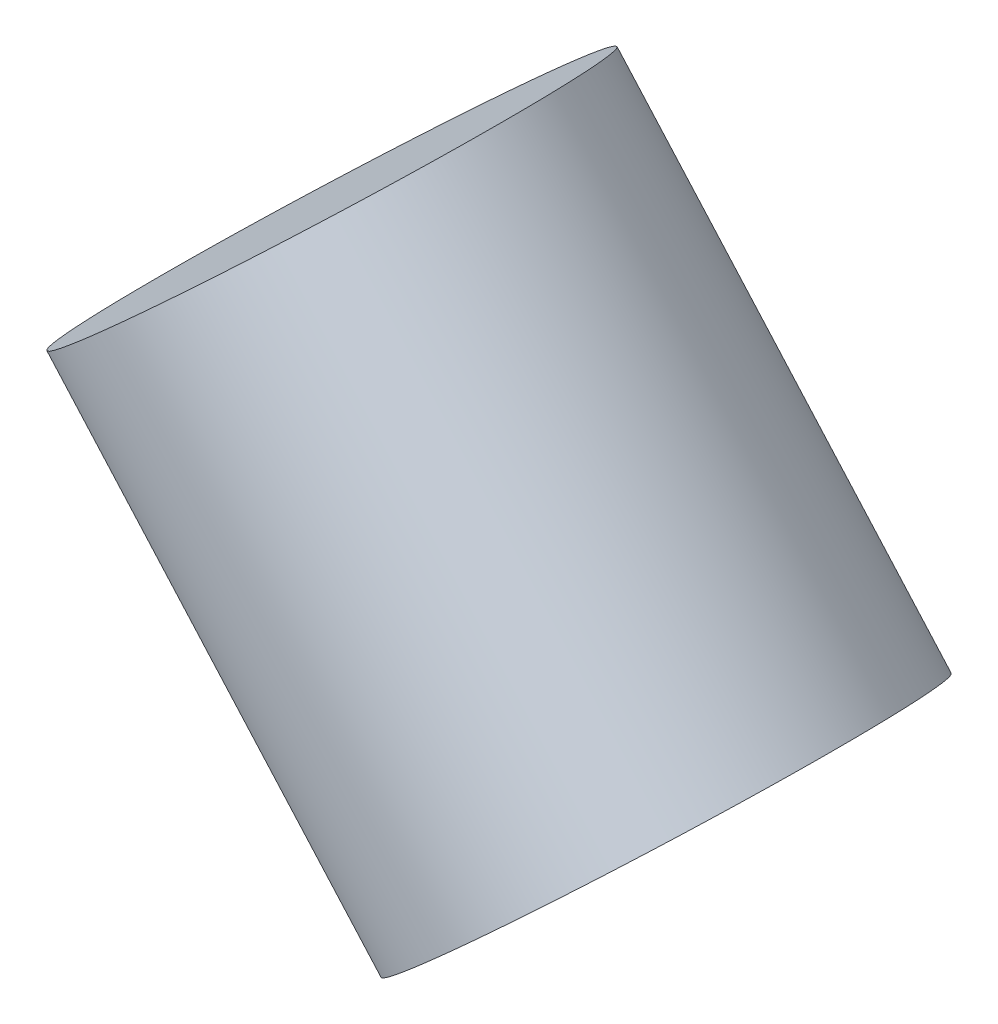
ISO-10303-21;
HEADER;
FILE_DESCRIPTION(('STEP AP214'),'2;1');
FILE_NAME('part.step','',(''),(''),'','','');
FILE_SCHEMA(('AUTOMOTIVE_DESIGN { 1 0 10303 214 1 1 1 1 }'));
ENDSEC;
DATA;
#1=APPLICATION_CONTEXT('core data for automotive mechanical design processes');
#2=APPLICATION_PROTOCOL_DEFINITION('international standard','automotive_design',2000,#1);
#3=PRODUCT_CONTEXT('',#1,'mechanical');
#4=PRODUCT('Part','Part','',(#3));
#5=PRODUCT_RELATED_PRODUCT_CATEGORY('part','',(#4));
#6=PRODUCT_DEFINITION_FORMATION('','',#4);
#7=PRODUCT_DEFINITION_CONTEXT('part definition',#1,'design');
#8=PRODUCT_DEFINITION('design','',#6,#7);
#9=PRODUCT_DEFINITION_SHAPE('','',#8);
#10=(LENGTH_UNIT() NAMED_UNIT(*) SI_UNIT(.MILLI.,.METRE.));
#11=(NAMED_UNIT(*) PLANE_ANGLE_UNIT() SI_UNIT($,.RADIAN.));
#12=(NAMED_UNIT(*) SI_UNIT($,.STERADIAN.) SOLID_ANGLE_UNIT());
#13=UNCERTAINTY_MEASURE_WITH_UNIT(LENGTH_MEASURE(1.E-05),#10,'distance_accuracy_value','');
#14=(GEOMETRIC_REPRESENTATION_CONTEXT(3) GLOBAL_UNCERTAINTY_ASSIGNED_CONTEXT((#13)) GLOBAL_UNIT_ASSIGNED_CONTEXT((#10,
#11,#12)) REPRESENTATION_CONTEXT('',''));
#15=CARTESIAN_POINT('',(0.,0.,0.));
#16=DIRECTION('',(0.,0.,1.));
#17=DIRECTION('',(1.,0.,0.));
#18=AXIS2_PLACEMENT_3D('',#15,#16,#17);
#19=CARTESIAN_POINT('',(70.8192282172992,-16.9151301511175,-22.6758389365389));
#20=DIRECTION('',(0.664699798962186,-0.747110552234159,0.));
#21=DIRECTION('',(0.747110552234159,0.664699798962186,0.));
#22=AXIS2_PLACEMENT_3D('',#19,#20,#21);
#23=PLANE('',#22);
#24=CARTESIAN_POINT('',(72.2730223935092,-15.6216981499638,-27.368377284982));
#25=DIRECTION('',(0.664699798962186,-0.747110552234159,0.));
#26=DIRECTION('',(0.747110552234159,0.664699798962186,0.));
#27=AXIS2_PLACEMENT_3D('',#24,#25,#26);
#28=CIRCLE('',#27,1.905);
#29=CARTESIAN_POINT('',(73.6962679955153,-14.3554450329409,-27.368377284982));
#30=VERTEX_POINT('',#29);
#31=EDGE_CURVE('E17',#30,#30,#28,.T.);
#32=ORIENTED_EDGE('',*,*,#31,.F.);
#33=EDGE_LOOP('',(#32));
#34=FACE_BOUND('',#33,.T.);
#35=ADVANCED_FACE('F14',(#34),#23,.F.);
#36=CARTESIAN_POINT('',(75.0587792509599,-18.752838474377,-27.368377284982));
#37=DIRECTION('',(0.664699798962186,-0.747110552234159,0.));
#38=DIRECTION('',(0.747110552234159,0.664699798962186,0.));
#39=AXIS2_PLACEMENT_3D('',#36,#37,#38);
#40=PLANE('',#39);
#41=CARTESIAN_POINT('',(75.0587792509597,-18.7528384743772,-27.368377284982));
#42=DIRECTION('',(0.664699798962186,-0.747110552234159,0.));
#43=DIRECTION('',(0.747110552234159,0.664699798962186,0.));
#44=AXIS2_PLACEMENT_3D('',#41,#42,#43);
#45=CIRCLE('',#44,1.905);
#46=CARTESIAN_POINT('',(76.4820248529658,-17.4865853573542,-27.368377284982));
#47=VERTEX_POINT('',#46);
#48=EDGE_CURVE('E10',#47,#47,#45,.F.);
#49=ORIENTED_EDGE('',*,*,#48,.F.);
#50=EDGE_LOOP('',(#49));
#51=FACE_BOUND('',#50,.T.);
#52=ADVANCED_FACE('F29',(#51),#40,.T.);
#53=CARTESIAN_POINT('',(68.691517730527,-11.5961516840741,-27.368377284982));
#54=DIRECTION('',(0.664699798962186,-0.747110552234159,0.));
#55=DIRECTION('',(0.747110552234159,0.664699798962186,0.));
#56=AXIS2_PLACEMENT_3D('',#53,#54,#55);
#57=CYLINDRICAL_SURFACE('',#56,1.905);
#58=ORIENTED_EDGE('',*,*,#48,.T.);
#59=EDGE_LOOP('',(#58));
#60=FACE_BOUND('',#59,.T.);
#61=ORIENTED_EDGE('',*,*,#31,.T.);
#62=EDGE_LOOP('',(#61));
#63=FACE_BOUND('',#62,.T.);
#64=ADVANCED_FACE('F26',(#60,#63),#57,.T.);
#65=CLOSED_SHELL('',(#35,#52,#64));
#66=MANIFOLD_SOLID_BREP('B1',#65);
#67=ADVANCED_BREP_SHAPE_REPRESENTATION('',(#18,#66),#14);
#68=SHAPE_DEFINITION_REPRESENTATION(#9,#67);
ENDSEC;
END-ISO-10303-21;
